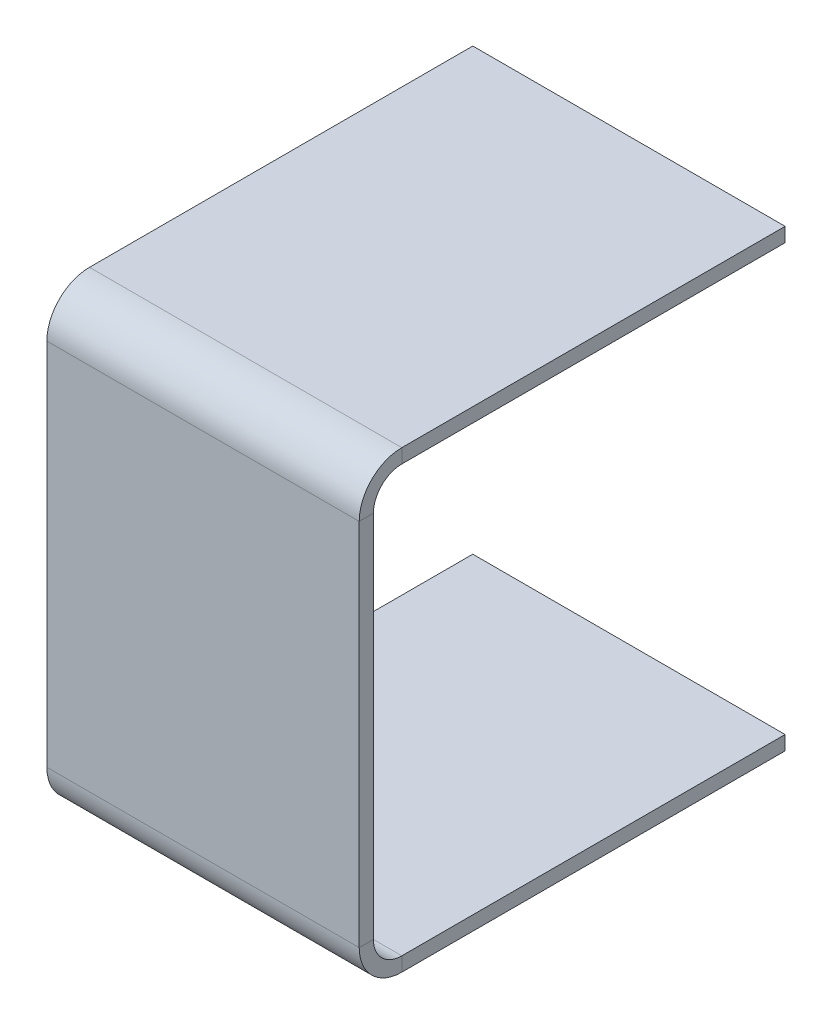
ISO-10303-21;
HEADER;
FILE_DESCRIPTION(('STEP AP214'),'2;1');
FILE_NAME('part.step','',(''),(''),'','','');
FILE_SCHEMA(('AUTOMOTIVE_DESIGN { 1 0 10303 214 1 1 1 1 }'));
ENDSEC;
DATA;
#1=APPLICATION_CONTEXT('core data for automotive mechanical design processes');
#2=APPLICATION_PROTOCOL_DEFINITION('international standard','automotive_design',2000,#1);
#3=PRODUCT_CONTEXT('',#1,'mechanical');
#4=PRODUCT('Part','Part','',(#3));
#5=PRODUCT_RELATED_PRODUCT_CATEGORY('part','',(#4));
#6=PRODUCT_DEFINITION_FORMATION('','',#4);
#7=PRODUCT_DEFINITION_CONTEXT('part definition',#1,'design');
#8=PRODUCT_DEFINITION('design','',#6,#7);
#9=PRODUCT_DEFINITION_SHAPE('','',#8);
#10=(LENGTH_UNIT() NAMED_UNIT(*) SI_UNIT(.MILLI.,.METRE.));
#11=(NAMED_UNIT(*) PLANE_ANGLE_UNIT() SI_UNIT($,.RADIAN.));
#12=(NAMED_UNIT(*) SI_UNIT($,.STERADIAN.) SOLID_ANGLE_UNIT());
#13=UNCERTAINTY_MEASURE_WITH_UNIT(LENGTH_MEASURE(1.E-05),#10,'distance_accuracy_value','');
#14=(GEOMETRIC_REPRESENTATION_CONTEXT(3) GLOBAL_UNCERTAINTY_ASSIGNED_CONTEXT((#13)) GLOBAL_UNIT_ASSIGNED_CONTEXT((#10,
#11,#12)) REPRESENTATION_CONTEXT('',''));
#15=CARTESIAN_POINT('',(0.,0.,0.));
#16=DIRECTION('',(0.,0.,1.));
#17=DIRECTION('',(1.,0.,0.));
#18=AXIS2_PLACEMENT_3D('',#15,#16,#17);
#19=CARTESIAN_POINT('',(0.,0.,0.));
#20=DIRECTION('',(0.,0.,-1.));
#21=DIRECTION('',(1.,0.,0.));
#22=AXIS2_PLACEMENT_3D('',#19,#20,#21);
#23=PLANE('',#22);
#24=DIRECTION('',(0.,-1.,0.));
#25=VECTOR('',#24,1.);
#26=CARTESIAN_POINT('',(11.,-16.,0.));
#27=LINE('',#26,#25);
#28=CARTESIAN_POINT('',(11.,-15.,0.));
#29=VERTEX_POINT('',#28);
#30=CARTESIAN_POINT('',(11.,-16.,0.));
#31=VERTEX_POINT('',#30);
#32=EDGE_CURVE('E156',#29,#31,#27,.T.);
#33=ORIENTED_EDGE('',*,*,#32,.T.);
#34=DIRECTION('',(-1.,0.,0.));
#35=VECTOR('',#34,1.);
#36=CARTESIAN_POINT('',(-11.,-16.,0.));
#37=LINE('',#36,#35);
#38=CARTESIAN_POINT('',(-11.,-16.,0.));
#39=VERTEX_POINT('',#38);
#40=EDGE_CURVE('E155',#31,#39,#37,.T.);
#41=ORIENTED_EDGE('',*,*,#40,.T.);
#42=DIRECTION('',(0.,1.,0.));
#43=VECTOR('',#42,1.);
#44=CARTESIAN_POINT('',(-11.,-16.,0.));
#45=LINE('',#44,#43);
#46=CARTESIAN_POINT('',(-11.,-15.,0.));
#47=VERTEX_POINT('',#46);
#48=EDGE_CURVE('E142',#39,#47,#45,.T.);
#49=ORIENTED_EDGE('',*,*,#48,.T.);
#50=DIRECTION('',(1.,0.,0.));
#51=VECTOR('',#50,1.);
#52=CARTESIAN_POINT('',(-11.,-15.,0.));
#53=LINE('',#52,#51);
#54=EDGE_CURVE('E152',#47,#29,#53,.T.);
#55=ORIENTED_EDGE('',*,*,#54,.T.);
#56=EDGE_LOOP('',(#33,#41,#49,#55));
#57=FACE_BOUND('',#56,.T.);
#58=ADVANCED_FACE('F34',(#57),#23,.T.);
#59=CARTESIAN_POINT('',(0.,0.,0.));
#60=DIRECTION('',(0.,0.,1.));
#61=DIRECTION('',(1.,0.,0.));
#62=AXIS2_PLACEMENT_3D('',#59,#60,#61);
#63=PLANE('',#62);
#64=DIRECTION('',(0.,1.,0.));
#65=VECTOR('',#64,1.);
#66=CARTESIAN_POINT('',(11.,16.,0.));
#67=LINE('',#66,#65);
#68=CARTESIAN_POINT('',(11.,15.,0.));
#69=VERTEX_POINT('',#68);
#70=CARTESIAN_POINT('',(11.,16.,0.));
#71=VERTEX_POINT('',#70);
#72=EDGE_CURVE('E48',#69,#71,#67,.T.);
#73=ORIENTED_EDGE('',*,*,#72,.F.);
#74=DIRECTION('',(1.,0.,0.));
#75=VECTOR('',#74,1.);
#76=CARTESIAN_POINT('',(-11.,15.,0.));
#77=LINE('',#76,#75);
#78=CARTESIAN_POINT('',(-11.,15.,0.));
#79=VERTEX_POINT('',#78);
#80=EDGE_CURVE('E57',#79,#69,#77,.T.);
#81=ORIENTED_EDGE('',*,*,#80,.F.);
#82=DIRECTION('',(0.,-1.,0.));
#83=VECTOR('',#82,1.);
#84=CARTESIAN_POINT('',(-11.,16.,0.));
#85=LINE('',#84,#83);
#86=CARTESIAN_POINT('',(-11.,16.,0.));
#87=VERTEX_POINT('',#86);
#88=EDGE_CURVE('E200',#87,#79,#85,.T.);
#89=ORIENTED_EDGE('',*,*,#88,.F.);
#90=DIRECTION('',(-1.,0.,0.));
#91=VECTOR('',#90,1.);
#92=CARTESIAN_POINT('',(-11.,16.,0.));
#93=LINE('',#92,#91);
#94=EDGE_CURVE('E11',#71,#87,#93,.T.);
#95=ORIENTED_EDGE('',*,*,#94,.F.);
#96=EDGE_LOOP('',(#73,#81,#89,#95));
#97=FACE_BOUND('',#96,.T.);
#98=ADVANCED_FACE('F304',(#97),#63,.F.);
#99=CARTESIAN_POINT('',(-11.,-16.,0.));
#100=DIRECTION('',(1.,0.,0.));
#101=DIRECTION('',(0.,0.,-1.));
#102=AXIS2_PLACEMENT_3D('',#99,#100,#101);
#103=PLANE('',#102);
#104=DIRECTION('',(0.,0.,1.));
#105=VECTOR('',#104,1.);
#106=CARTESIAN_POINT('',(-11.,-15.,0.));
#107=LINE('',#106,#105);
#108=CARTESIAN_POINT('',(-11.,-15.,27.));
#109=VERTEX_POINT('',#108);
#110=EDGE_CURVE('E149',#47,#109,#107,.T.);
#111=ORIENTED_EDGE('',*,*,#110,.F.);
#112=ORIENTED_EDGE('',*,*,#48,.F.);
#113=DIRECTION('',(0.,0.,1.));
#114=VECTOR('',#113,1.);
#115=CARTESIAN_POINT('',(-11.,-16.,0.));
#116=LINE('',#115,#114);
#117=CARTESIAN_POINT('',(-11.,-16.,27.));
#118=VERTEX_POINT('',#117);
#119=EDGE_CURVE('E147',#39,#118,#116,.T.);
#120=ORIENTED_EDGE('',*,*,#119,.T.);
#121=DIRECTION('',(0.,1.,0.));
#122=VECTOR('',#121,1.);
#123=CARTESIAN_POINT('',(-11.,-16.,27.));
#124=LINE('',#123,#122);
#125=EDGE_CURVE('E166',#118,#109,#124,.T.);
#126=ORIENTED_EDGE('',*,*,#125,.T.);
#127=EDGE_LOOP('',(#111,#112,#120,#126));
#128=FACE_BOUND('',#127,.T.);
#129=ADVANCED_FACE('F144',(#128),#103,.F.);
#130=CARTESIAN_POINT('',(-11.,-15.,0.));
#131=DIRECTION('',(0.,-1.,0.));
#132=DIRECTION('',(0.,0.,-1.));
#133=AXIS2_PLACEMENT_3D('',#130,#131,#132);
#134=PLANE('',#133);
#135=DIRECTION('',(0.,0.,1.));
#136=VECTOR('',#135,1.);
#137=CARTESIAN_POINT('',(11.,-15.,0.));
#138=LINE('',#137,#136);
#139=CARTESIAN_POINT('',(11.,-15.,27.));
#140=VERTEX_POINT('',#139);
#141=EDGE_CURVE('E211',#29,#140,#138,.T.);
#142=ORIENTED_EDGE('',*,*,#141,.F.);
#143=ORIENTED_EDGE('',*,*,#54,.F.);
#144=ORIENTED_EDGE('',*,*,#110,.T.);
#145=DIRECTION('',(1.,0.,0.));
#146=VECTOR('',#145,1.);
#147=CARTESIAN_POINT('',(-11.,-15.,27.));
#148=LINE('',#147,#146);
#149=EDGE_CURVE('E208',#109,#140,#148,.T.);
#150=ORIENTED_EDGE('',*,*,#149,.T.);
#151=EDGE_LOOP('',(#142,#143,#144,#150));
#152=FACE_BOUND('',#151,.T.);
#153=ADVANCED_FACE('F311',(#152),#134,.F.);
#154=CARTESIAN_POINT('',(11.,-16.,0.));
#155=DIRECTION('',(-1.,0.,0.));
#156=DIRECTION('',(0.,0.,1.));
#157=AXIS2_PLACEMENT_3D('',#154,#155,#156);
#158=PLANE('',#157);
#159=DIRECTION('',(0.,0.,1.));
#160=VECTOR('',#159,1.);
#161=CARTESIAN_POINT('',(11.,-16.,0.));
#162=LINE('',#161,#160);
#163=CARTESIAN_POINT('',(11.,-16.,27.));
#164=VERTEX_POINT('',#163);
#165=EDGE_CURVE('E235',#31,#164,#162,.T.);
#166=ORIENTED_EDGE('',*,*,#165,.F.);
#167=ORIENTED_EDGE('',*,*,#32,.F.);
#168=ORIENTED_EDGE('',*,*,#141,.T.);
#169=DIRECTION('',(0.,-1.,0.));
#170=VECTOR('',#169,1.);
#171=CARTESIAN_POINT('',(11.,-16.,27.));
#172=LINE('',#171,#170);
#173=EDGE_CURVE('E214',#140,#164,#172,.T.);
#174=ORIENTED_EDGE('',*,*,#173,.T.);
#175=EDGE_LOOP('',(#166,#167,#168,#174));
#176=FACE_BOUND('',#175,.T.);
#177=ADVANCED_FACE('F298',(#176),#158,.F.);
#178=CARTESIAN_POINT('',(-11.,-16.,0.));
#179=DIRECTION('',(0.,1.,0.));
#180=DIRECTION('',(0.,0.,1.));
#181=AXIS2_PLACEMENT_3D('',#178,#179,#180);
#182=PLANE('',#181);
#183=DIRECTION('',(-1.,0.,0.));
#184=VECTOR('',#183,1.);
#185=CARTESIAN_POINT('',(-11.,-16.,27.));
#186=LINE('',#185,#184);
#187=EDGE_CURVE('E164',#164,#118,#186,.T.);
#188=ORIENTED_EDGE('',*,*,#187,.T.);
#189=ORIENTED_EDGE('',*,*,#119,.F.);
#190=ORIENTED_EDGE('',*,*,#40,.F.);
#191=ORIENTED_EDGE('',*,*,#165,.T.);
#192=EDGE_LOOP('',(#188,#189,#190,#191));
#193=FACE_BOUND('',#192,.T.);
#194=ADVANCED_FACE('F162',(#193),#182,.F.);
#195=CARTESIAN_POINT('',(-11.,-16.,27.));
#196=DIRECTION('',(1.,0.,0.));
#197=DIRECTION('',(0.,0.,-1.));
#198=AXIS2_PLACEMENT_3D('',#195,#196,#197);
#199=PLANE('',#198);
#200=CARTESIAN_POINT('',(-11.,-13.,27.));
#201=DIRECTION('',(-1.,0.,0.));
#202=DIRECTION('',(0.,-1.,0.));
#203=AXIS2_PLACEMENT_3D('',#200,#201,#202);
#204=CIRCLE('',#203,2.);
#205=CARTESIAN_POINT('',(-11.,-13.,29.));
#206=VERTEX_POINT('',#205);
#207=EDGE_CURVE('E174',#109,#206,#204,.T.);
#208=ORIENTED_EDGE('',*,*,#207,.F.);
#209=ORIENTED_EDGE('',*,*,#125,.F.);
#210=CARTESIAN_POINT('',(-11.,-13.,27.));
#211=DIRECTION('',(-1.,0.,0.));
#212=DIRECTION('',(0.,-1.,0.));
#213=AXIS2_PLACEMENT_3D('',#210,#211,#212);
#214=CIRCLE('',#213,3.);
#215=CARTESIAN_POINT('',(-11.,-13.,30.));
#216=VERTEX_POINT('',#215);
#217=EDGE_CURVE('E175',#118,#216,#214,.T.);
#218=ORIENTED_EDGE('',*,*,#217,.T.);
#219=DIRECTION('',(0.,0.,-1.));
#220=VECTOR('',#219,1.);
#221=CARTESIAN_POINT('',(-11.,-13.,30.));
#222=LINE('',#221,#220);
#223=EDGE_CURVE('E171',#216,#206,#222,.T.);
#224=ORIENTED_EDGE('',*,*,#223,.T.);
#225=EDGE_LOOP('',(#208,#209,#218,#224));
#226=FACE_BOUND('',#225,.T.);
#227=ADVANCED_FACE('F297',(#226),#199,.F.);
#228=CARTESIAN_POINT('',(0.,-13.,27.));
#229=DIRECTION('',(-1.,0.,0.));
#230=DIRECTION('',(0.,0.,1.));
#231=AXIS2_PLACEMENT_3D('',#228,#229,#230);
#232=CYLINDRICAL_SURFACE('',#231,2.);
#233=CARTESIAN_POINT('',(11.,-13.,27.));
#234=DIRECTION('',(-1.,0.,0.));
#235=DIRECTION('',(0.,-1.,0.));
#236=AXIS2_PLACEMENT_3D('',#233,#234,#235);
#237=CIRCLE('',#236,2.);
#238=CARTESIAN_POINT('',(11.,-13.,29.));
#239=VERTEX_POINT('',#238);
#240=EDGE_CURVE('E217',#140,#239,#237,.T.);
#241=ORIENTED_EDGE('',*,*,#240,.F.);
#242=ORIENTED_EDGE('',*,*,#149,.F.);
#243=ORIENTED_EDGE('',*,*,#207,.T.);
#244=DIRECTION('',(1.,0.,0.));
#245=VECTOR('',#244,1.);
#246=CARTESIAN_POINT('',(-11.,-13.,29.));
#247=LINE('',#246,#245);
#248=EDGE_CURVE('E178',#206,#239,#247,.T.);
#249=ORIENTED_EDGE('',*,*,#248,.T.);
#250=EDGE_LOOP('',(#241,#242,#243,#249));
#251=FACE_BOUND('',#250,.T.);
#252=ADVANCED_FACE('F320',(#251),#232,.F.);
#253=CARTESIAN_POINT('',(11.,-16.,27.));
#254=DIRECTION('',(-1.,0.,0.));
#255=DIRECTION('',(0.,0.,1.));
#256=AXIS2_PLACEMENT_3D('',#253,#254,#255);
#257=PLANE('',#256);
#258=CARTESIAN_POINT('',(11.,-13.,27.));
#259=DIRECTION('',(-1.,0.,0.));
#260=DIRECTION('',(0.,-1.,0.));
#261=AXIS2_PLACEMENT_3D('',#258,#259,#260);
#262=CIRCLE('',#261,3.);
#263=CARTESIAN_POINT('',(11.,-13.,30.));
#264=VERTEX_POINT('',#263);
#265=EDGE_CURVE('E239',#164,#264,#262,.T.);
#266=ORIENTED_EDGE('',*,*,#265,.F.);
#267=ORIENTED_EDGE('',*,*,#173,.F.);
#268=ORIENTED_EDGE('',*,*,#240,.T.);
#269=DIRECTION('',(0.,0.,1.));
#270=VECTOR('',#269,1.);
#271=CARTESIAN_POINT('',(11.,-13.,30.));
#272=LINE('',#271,#270);
#273=EDGE_CURVE('E220',#239,#264,#272,.T.);
#274=ORIENTED_EDGE('',*,*,#273,.T.);
#275=EDGE_LOOP('',(#266,#267,#268,#274));
#276=FACE_BOUND('',#275,.T.);
#277=ADVANCED_FACE('F276',(#276),#257,.F.);
#278=CARTESIAN_POINT('',(0.,-13.,27.));
#279=DIRECTION('',(-1.,0.,0.));
#280=DIRECTION('',(0.,0.,1.));
#281=AXIS2_PLACEMENT_3D('',#278,#279,#280);
#282=CYLINDRICAL_SURFACE('',#281,3.);
#283=DIRECTION('',(-1.,0.,0.));
#284=VECTOR('',#283,1.);
#285=CARTESIAN_POINT('',(-11.,-13.,30.));
#286=LINE('',#285,#284);
#287=EDGE_CURVE('E191',#264,#216,#286,.T.);
#288=ORIENTED_EDGE('',*,*,#287,.T.);
#289=ORIENTED_EDGE('',*,*,#217,.F.);
#290=ORIENTED_EDGE('',*,*,#187,.F.);
#291=ORIENTED_EDGE('',*,*,#265,.T.);
#292=EDGE_LOOP('',(#288,#289,#290,#291));
#293=FACE_BOUND('',#292,.T.);
#294=ADVANCED_FACE('F272',(#293),#282,.T.);
#295=CARTESIAN_POINT('',(-11.,-13.,30.));
#296=DIRECTION('',(1.,0.,0.));
#297=DIRECTION('',(0.,0.,-1.));
#298=AXIS2_PLACEMENT_3D('',#295,#296,#297);
#299=PLANE('',#298);
#300=DIRECTION('',(0.,1.,0.));
#301=VECTOR('',#300,1.);
#302=CARTESIAN_POINT('',(-11.,-13.,29.));
#303=LINE('',#302,#301);
#304=CARTESIAN_POINT('',(-11.,13.,29.));
#305=VERTEX_POINT('',#304);
#306=EDGE_CURVE('E184',#206,#305,#303,.T.);
#307=ORIENTED_EDGE('',*,*,#306,.F.);
#308=ORIENTED_EDGE('',*,*,#223,.F.);
#309=DIRECTION('',(0.,1.,0.));
#310=VECTOR('',#309,1.);
#311=CARTESIAN_POINT('',(-11.,-13.,30.));
#312=LINE('',#311,#310);
#313=CARTESIAN_POINT('',(-11.,13.,30.));
#314=VERTEX_POINT('',#313);
#315=EDGE_CURVE('E185',#216,#314,#312,.T.);
#316=ORIENTED_EDGE('',*,*,#315,.T.);
#317=DIRECTION('',(0.,0.,-1.));
#318=VECTOR('',#317,1.);
#319=CARTESIAN_POINT('',(-11.,13.,30.));
#320=LINE('',#319,#318);
#321=EDGE_CURVE('E181',#314,#305,#320,.T.);
#322=ORIENTED_EDGE('',*,*,#321,.T.);
#323=EDGE_LOOP('',(#307,#308,#316,#322));
#324=FACE_BOUND('',#323,.T.);
#325=ADVANCED_FACE('F267',(#324),#299,.F.);
#326=CARTESIAN_POINT('',(-11.,-13.,29.));
#327=DIRECTION('',(0.,0.,1.));
#328=DIRECTION('',(1.,0.,0.));
#329=AXIS2_PLACEMENT_3D('',#326,#327,#328);
#330=PLANE('',#329);
#331=DIRECTION('',(0.,1.,0.));
#332=VECTOR('',#331,1.);
#333=CARTESIAN_POINT('',(11.,-13.,29.));
#334=LINE('',#333,#332);
#335=CARTESIAN_POINT('',(11.,13.,29.));
#336=VERTEX_POINT('',#335);
#337=EDGE_CURVE('E223',#239,#336,#334,.T.);
#338=ORIENTED_EDGE('',*,*,#337,.F.);
#339=ORIENTED_EDGE('',*,*,#248,.F.);
#340=ORIENTED_EDGE('',*,*,#306,.T.);
#341=DIRECTION('',(1.,0.,0.));
#342=VECTOR('',#341,1.);
#343=CARTESIAN_POINT('',(-11.,13.,29.));
#344=LINE('',#343,#342);
#345=EDGE_CURVE('E188',#305,#336,#344,.T.);
#346=ORIENTED_EDGE('',*,*,#345,.T.);
#347=EDGE_LOOP('',(#338,#339,#340,#346));
#348=FACE_BOUND('',#347,.T.);
#349=ADVANCED_FACE('F317',(#348),#330,.F.);
#350=CARTESIAN_POINT('',(11.,-13.,30.));
#351=DIRECTION('',(-1.,0.,0.));
#352=DIRECTION('',(0.,0.,1.));
#353=AXIS2_PLACEMENT_3D('',#350,#351,#352);
#354=PLANE('',#353);
#355=DIRECTION('',(0.,1.,0.));
#356=VECTOR('',#355,1.);
#357=CARTESIAN_POINT('',(11.,-13.,30.));
#358=LINE('',#357,#356);
#359=CARTESIAN_POINT('',(11.,13.,30.));
#360=VERTEX_POINT('',#359);
#361=EDGE_CURVE('E244',#264,#360,#358,.T.);
#362=ORIENTED_EDGE('',*,*,#361,.F.);
#363=ORIENTED_EDGE('',*,*,#273,.F.);
#364=ORIENTED_EDGE('',*,*,#337,.T.);
#365=DIRECTION('',(0.,0.,1.));
#366=VECTOR('',#365,1.);
#367=CARTESIAN_POINT('',(11.,13.,30.));
#368=LINE('',#367,#366);
#369=EDGE_CURVE('E226',#336,#360,#368,.T.);
#370=ORIENTED_EDGE('',*,*,#369,.T.);
#371=EDGE_LOOP('',(#362,#363,#364,#370));
#372=FACE_BOUND('',#371,.T.);
#373=ADVANCED_FACE('F278',(#372),#354,.F.);
#374=CARTESIAN_POINT('',(-11.,-13.,30.));
#375=DIRECTION('',(0.,0.,-1.));
#376=DIRECTION('',(-1.,0.,0.));
#377=AXIS2_PLACEMENT_3D('',#374,#375,#376);
#378=PLANE('',#377);
#379=DIRECTION('',(-1.,0.,0.));
#380=VECTOR('',#379,1.);
#381=CARTESIAN_POINT('',(-11.,13.,30.));
#382=LINE('',#381,#380);
#383=EDGE_CURVE('E199',#360,#314,#382,.T.);
#384=ORIENTED_EDGE('',*,*,#383,.T.);
#385=ORIENTED_EDGE('',*,*,#315,.F.);
#386=ORIENTED_EDGE('',*,*,#287,.F.);
#387=ORIENTED_EDGE('',*,*,#361,.T.);
#388=EDGE_LOOP('',(#384,#385,#386,#387));
#389=FACE_BOUND('',#388,.T.);
#390=ADVANCED_FACE('F270',(#389),#378,.F.);
#391=CARTESIAN_POINT('',(-11.,13.,30.));
#392=DIRECTION('',(1.,0.,0.));
#393=DIRECTION('',(0.,0.,-1.));
#394=AXIS2_PLACEMENT_3D('',#391,#392,#393);
#395=PLANE('',#394);
#396=CARTESIAN_POINT('',(-11.,13.,27.));
#397=DIRECTION('',(-1.,0.,0.));
#398=DIRECTION('',(0.,0.,1.));
#399=AXIS2_PLACEMENT_3D('',#396,#397,#398);
#400=CIRCLE('',#399,2.);
#401=CARTESIAN_POINT('',(-11.,15.,27.));
#402=VERTEX_POINT('',#401);
#403=EDGE_CURVE('E122',#305,#402,#400,.T.);
#404=ORIENTED_EDGE('',*,*,#403,.F.);
#405=ORIENTED_EDGE('',*,*,#321,.F.);
#406=CARTESIAN_POINT('',(-11.,13.,27.));
#407=DIRECTION('',(-1.,0.,0.));
#408=DIRECTION('',(0.,0.,1.));
#409=AXIS2_PLACEMENT_3D('',#406,#407,#408);
#410=CIRCLE('',#409,3.);
#411=CARTESIAN_POINT('',(-11.,16.,27.));
#412=VERTEX_POINT('',#411);
#413=EDGE_CURVE('E194',#314,#412,#410,.T.);
#414=ORIENTED_EDGE('',*,*,#413,.T.);
#415=DIRECTION('',(0.,-1.,0.));
#416=VECTOR('',#415,1.);
#417=CARTESIAN_POINT('',(-11.,16.,27.));
#418=LINE('',#417,#416);
#419=EDGE_CURVE('E192',#412,#402,#418,.T.);
#420=ORIENTED_EDGE('',*,*,#419,.T.);
#421=EDGE_LOOP('',(#404,#405,#414,#420));
#422=FACE_BOUND('',#421,.T.);
#423=ADVANCED_FACE('F264',(#422),#395,.F.);
#424=CARTESIAN_POINT('',(0.,13.,27.));
#425=DIRECTION('',(-1.,0.,0.));
#426=DIRECTION('',(0.,0.,1.));
#427=AXIS2_PLACEMENT_3D('',#424,#425,#426);
#428=CYLINDRICAL_SURFACE('',#427,2.);
#429=CARTESIAN_POINT('',(11.,13.,27.));
#430=DIRECTION('',(-1.,0.,0.));
#431=DIRECTION('',(0.,0.,1.));
#432=AXIS2_PLACEMENT_3D('',#429,#430,#431);
#433=CIRCLE('',#432,2.);
#434=CARTESIAN_POINT('',(11.,15.,27.));
#435=VERTEX_POINT('',#434);
#436=EDGE_CURVE('E115',#336,#435,#433,.T.);
#437=ORIENTED_EDGE('',*,*,#436,.F.);
#438=ORIENTED_EDGE('',*,*,#345,.F.);
#439=ORIENTED_EDGE('',*,*,#403,.T.);
#440=DIRECTION('',(1.,0.,0.));
#441=VECTOR('',#440,1.);
#442=CARTESIAN_POINT('',(-11.,15.,27.));
#443=LINE('',#442,#441);
#444=EDGE_CURVE('E196',#402,#435,#443,.T.);
#445=ORIENTED_EDGE('',*,*,#444,.T.);
#446=EDGE_LOOP('',(#437,#438,#439,#445));
#447=FACE_BOUND('',#446,.T.);
#448=ADVANCED_FACE('F314',(#447),#428,.F.);
#449=CARTESIAN_POINT('',(11.,13.,30.));
#450=DIRECTION('',(-1.,0.,0.));
#451=DIRECTION('',(0.,0.,1.));
#452=AXIS2_PLACEMENT_3D('',#449,#450,#451);
#453=PLANE('',#452);
#454=CARTESIAN_POINT('',(11.,13.,27.));
#455=DIRECTION('',(-1.,0.,0.));
#456=DIRECTION('',(0.,0.,1.));
#457=AXIS2_PLACEMENT_3D('',#454,#455,#456);
#458=CIRCLE('',#457,3.);
#459=CARTESIAN_POINT('',(11.,16.,27.));
#460=VERTEX_POINT('',#459);
#461=EDGE_CURVE('E249',#360,#460,#458,.T.);
#462=ORIENTED_EDGE('',*,*,#461,.F.);
#463=ORIENTED_EDGE('',*,*,#369,.F.);
#464=ORIENTED_EDGE('',*,*,#436,.T.);
#465=DIRECTION('',(0.,1.,0.));
#466=VECTOR('',#465,1.);
#467=CARTESIAN_POINT('',(11.,16.,27.));
#468=LINE('',#467,#466);
#469=EDGE_CURVE('E229',#435,#460,#468,.T.);
#470=ORIENTED_EDGE('',*,*,#469,.T.);
#471=EDGE_LOOP('',(#462,#463,#464,#470));
#472=FACE_BOUND('',#471,.T.);
#473=ADVANCED_FACE('F280',(#472),#453,.F.);
#474=CARTESIAN_POINT('',(0.,13.,27.));
#475=DIRECTION('',(-1.,0.,0.));
#476=DIRECTION('',(0.,0.,1.));
#477=AXIS2_PLACEMENT_3D('',#474,#475,#476);
#478=CYLINDRICAL_SURFACE('',#477,3.);
#479=DIRECTION('',(-1.,0.,0.));
#480=VECTOR('',#479,1.);
#481=CARTESIAN_POINT('',(-11.,16.,27.));
#482=LINE('',#481,#480);
#483=EDGE_CURVE('E206',#460,#412,#482,.T.);
#484=ORIENTED_EDGE('',*,*,#483,.T.);
#485=ORIENTED_EDGE('',*,*,#413,.F.);
#486=ORIENTED_EDGE('',*,*,#383,.F.);
#487=ORIENTED_EDGE('',*,*,#461,.T.);
#488=EDGE_LOOP('',(#484,#485,#486,#487));
#489=FACE_BOUND('',#488,.T.);
#490=ADVANCED_FACE('F260',(#489),#478,.T.);
#491=CARTESIAN_POINT('',(-11.,16.,27.));
#492=DIRECTION('',(1.,0.,0.));
#493=DIRECTION('',(0.,0.,-1.));
#494=AXIS2_PLACEMENT_3D('',#491,#492,#493);
#495=PLANE('',#494);
#496=DIRECTION('',(0.,0.,-1.));
#497=VECTOR('',#496,1.);
#498=CARTESIAN_POINT('',(-11.,15.,27.));
#499=LINE('',#498,#497);
#500=EDGE_CURVE('E96',#402,#79,#499,.T.);
#501=ORIENTED_EDGE('',*,*,#500,.F.);
#502=ORIENTED_EDGE('',*,*,#419,.F.);
#503=DIRECTION('',(0.,0.,-1.));
#504=VECTOR('',#503,1.);
#505=CARTESIAN_POINT('',(-11.,16.,27.));
#506=LINE('',#505,#504);
#507=EDGE_CURVE('E202',#412,#87,#506,.T.);
#508=ORIENTED_EDGE('',*,*,#507,.T.);
#509=ORIENTED_EDGE('',*,*,#88,.T.);
#510=EDGE_LOOP('',(#501,#502,#508,#509));
#511=FACE_BOUND('',#510,.T.);
#512=ADVANCED_FACE('F263',(#511),#495,.F.);
#513=CARTESIAN_POINT('',(-11.,15.,27.));
#514=DIRECTION('',(0.,1.,0.));
#515=DIRECTION('',(0.,0.,1.));
#516=AXIS2_PLACEMENT_3D('',#513,#514,#515);
#517=PLANE('',#516);
#518=DIRECTION('',(0.,0.,-1.));
#519=VECTOR('',#518,1.);
#520=CARTESIAN_POINT('',(11.,15.,27.));
#521=LINE('',#520,#519);
#522=EDGE_CURVE('E91',#435,#69,#521,.T.);
#523=ORIENTED_EDGE('',*,*,#522,.F.);
#524=ORIENTED_EDGE('',*,*,#444,.F.);
#525=ORIENTED_EDGE('',*,*,#500,.T.);
#526=ORIENTED_EDGE('',*,*,#80,.T.);
#527=EDGE_LOOP('',(#523,#524,#525,#526));
#528=FACE_BOUND('',#527,.T.);
#529=ADVANCED_FACE('F284',(#528),#517,.F.);
#530=CARTESIAN_POINT('',(11.,16.,27.));
#531=DIRECTION('',(-1.,0.,0.));
#532=DIRECTION('',(0.,0.,1.));
#533=AXIS2_PLACEMENT_3D('',#530,#531,#532);
#534=PLANE('',#533);
#535=DIRECTION('',(0.,0.,-1.));
#536=VECTOR('',#535,1.);
#537=CARTESIAN_POINT('',(11.,16.,27.));
#538=LINE('',#537,#536);
#539=EDGE_CURVE('E41',#460,#71,#538,.T.);
#540=ORIENTED_EDGE('',*,*,#539,.F.);
#541=ORIENTED_EDGE('',*,*,#469,.F.);
#542=ORIENTED_EDGE('',*,*,#522,.T.);
#543=ORIENTED_EDGE('',*,*,#72,.T.);
#544=EDGE_LOOP('',(#540,#541,#542,#543));
#545=FACE_BOUND('',#544,.T.);
#546=ADVANCED_FACE('F281',(#545),#534,.F.);
#547=CARTESIAN_POINT('',(-11.,16.,27.));
#548=DIRECTION('',(0.,-1.,0.));
#549=DIRECTION('',(0.,0.,-1.));
#550=AXIS2_PLACEMENT_3D('',#547,#548,#549);
#551=PLANE('',#550);
#552=ORIENTED_EDGE('',*,*,#94,.T.);
#553=ORIENTED_EDGE('',*,*,#507,.F.);
#554=ORIENTED_EDGE('',*,*,#483,.F.);
#555=ORIENTED_EDGE('',*,*,#539,.T.);
#556=EDGE_LOOP('',(#552,#553,#554,#555));
#557=FACE_BOUND('',#556,.T.);
#558=ADVANCED_FACE('F283',(#557),#551,.F.);
#559=CLOSED_SHELL('',(#58,#98,#129,#153,#177,#194,#227,#252,#277,#294,#325,#349,#373,#390,#423,
#448,#473,#490,#512,#529,#546,#558));
#560=MANIFOLD_SOLID_BREP('B2',#559);
#561=ADVANCED_BREP_SHAPE_REPRESENTATION('',(#18,#560),#14);
#562=SHAPE_DEFINITION_REPRESENTATION(#9,#561);
ENDSEC;
END-ISO-10303-21;
